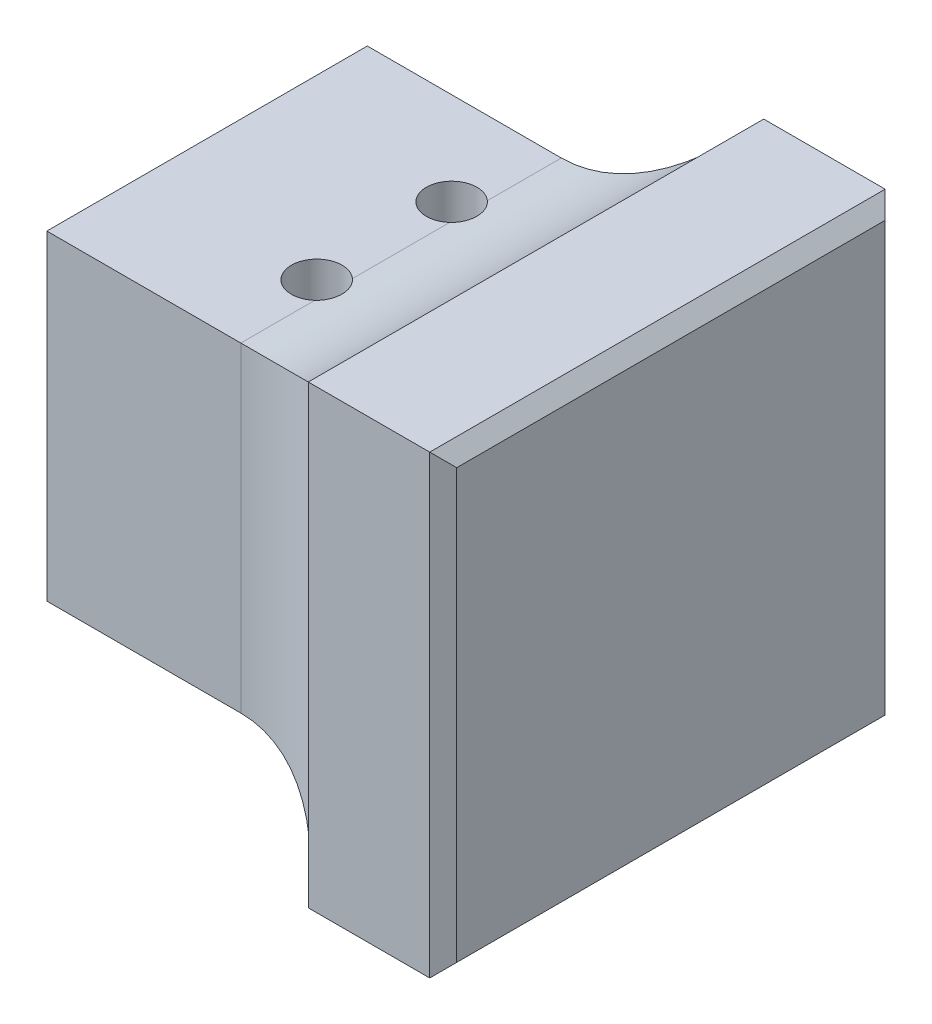
ISO-10303-21;
HEADER;
FILE_DESCRIPTION(('STEP AP214'),'2;1');
FILE_NAME('part.step','',(''),(''),'','','');
FILE_SCHEMA(('AUTOMOTIVE_DESIGN { 1 0 10303 214 1 1 1 1 }'));
ENDSEC;
DATA;
#1=APPLICATION_CONTEXT('core data for automotive mechanical design processes');
#2=APPLICATION_PROTOCOL_DEFINITION('international standard','automotive_design',2000,#1);
#3=PRODUCT_CONTEXT('',#1,'mechanical');
#4=PRODUCT('Part','Part','',(#3));
#5=PRODUCT_RELATED_PRODUCT_CATEGORY('part','',(#4));
#6=PRODUCT_DEFINITION_FORMATION('','',#4);
#7=PRODUCT_DEFINITION_CONTEXT('part definition',#1,'design');
#8=PRODUCT_DEFINITION('design','',#6,#7);
#9=PRODUCT_DEFINITION_SHAPE('','',#8);
#10=(LENGTH_UNIT() NAMED_UNIT(*) SI_UNIT(.MILLI.,.METRE.));
#11=(NAMED_UNIT(*) PLANE_ANGLE_UNIT() SI_UNIT($,.RADIAN.));
#12=(NAMED_UNIT(*) SI_UNIT($,.STERADIAN.) SOLID_ANGLE_UNIT());
#13=UNCERTAINTY_MEASURE_WITH_UNIT(LENGTH_MEASURE(1.E-05),#10,'distance_accuracy_value','');
#14=(GEOMETRIC_REPRESENTATION_CONTEXT(3) GLOBAL_UNCERTAINTY_ASSIGNED_CONTEXT((#13)) GLOBAL_UNIT_ASSIGNED_CONTEXT((#10,
#11,#12)) REPRESENTATION_CONTEXT('',''));
#15=CARTESIAN_POINT('',(0.,0.,0.));
#16=DIRECTION('',(0.,0.,1.));
#17=DIRECTION('',(1.,0.,0.));
#18=AXIS2_PLACEMENT_3D('',#15,#16,#17);
#19=CARTESIAN_POINT('',(0.,19.,0.));
#20=DIRECTION('',(0.,-1.,0.));
#21=DIRECTION('',(0.,0.,-1.));
#22=AXIS2_PLACEMENT_3D('',#19,#20,#21);
#23=PLANE('',#22);
#24=DIRECTION('',(1.,0.,0.));
#25=VECTOR('',#24,1.);
#26=CARTESIAN_POINT('',(0.,19.,0.));
#27=LINE('',#26,#25);
#28=CARTESIAN_POINT('',(1.50000000000001,19.,0.));
#29=VERTEX_POINT('',#28);
#30=CARTESIAN_POINT('',(13.,19.,0.));
#31=VERTEX_POINT('',#30);
#32=EDGE_CURVE('E209',#29,#31,#27,.T.);
#33=ORIENTED_EDGE('',*,*,#32,.T.);
#34=DIRECTION('',(0.,0.,1.));
#35=VECTOR('',#34,1.);
#36=CARTESIAN_POINT('',(13.,19.,0.));
#37=LINE('',#36,#35);
#38=CARTESIAN_POINT('',(13.,19.,-4.3819660112501));
#39=VERTEX_POINT('',#38);
#40=EDGE_CURVE('E258',#31,#39,#37,.F.);
#41=ORIENTED_EDGE('',*,*,#40,.T.);
#42=CARTESIAN_POINT('',(12.,19.,-5.5));
#43=DIRECTION('',(0.,1.,0.));
#44=DIRECTION('',(0.,0.,1.));
#45=AXIS2_PLACEMENT_3D('',#42,#43,#44);
#46=CIRCLE('',#45,1.5);
#47=CARTESIAN_POINT('',(13.,19.,-6.6180339887499));
#48=VERTEX_POINT('',#47);
#49=EDGE_CURVE('E195',#48,#39,#46,.T.);
#50=ORIENTED_EDGE('',*,*,#49,.F.);
#51=DIRECTION('',(0.,0.,1.));
#52=VECTOR('',#51,1.);
#53=CARTESIAN_POINT('',(13.,19.,0.));
#54=LINE('',#53,#52);
#55=CARTESIAN_POINT('',(13.,19.,-12.3819660112501));
#56=VERTEX_POINT('',#55);
#57=EDGE_CURVE('E256',#48,#56,#54,.F.);
#58=ORIENTED_EDGE('',*,*,#57,.T.);
#59=CARTESIAN_POINT('',(12.,19.,-13.5));
#60=DIRECTION('',(0.,1.,0.));
#61=DIRECTION('',(0.,0.,1.));
#62=AXIS2_PLACEMENT_3D('',#59,#60,#61);
#63=CIRCLE('',#62,1.5);
#64=CARTESIAN_POINT('',(13.,19.,-14.6180339887499));
#65=VERTEX_POINT('',#64);
#66=EDGE_CURVE('E203',#65,#56,#63,.T.);
#67=ORIENTED_EDGE('',*,*,#66,.F.);
#68=DIRECTION('',(0.,0.,1.));
#69=VECTOR('',#68,1.);
#70=CARTESIAN_POINT('',(13.,19.,0.));
#71=LINE('',#70,#69);
#72=CARTESIAN_POINT('',(13.,19.,-19.));
#73=VERTEX_POINT('',#72);
#74=EDGE_CURVE('E254',#65,#73,#71,.F.);
#75=ORIENTED_EDGE('',*,*,#74,.T.);
#76=DIRECTION('',(-1.,0.,0.));
#77=VECTOR('',#76,1.);
#78=CARTESIAN_POINT('',(0.,19.,-19.));
#79=LINE('',#78,#77);
#80=CARTESIAN_POINT('',(1.50000000000001,19.,-19.));
#81=VERTEX_POINT('',#80);
#82=EDGE_CURVE('E212',#73,#81,#79,.T.);
#83=ORIENTED_EDGE('',*,*,#82,.T.);
#84=DIRECTION('',(0.,0.,1.));
#85=VECTOR('',#84,1.);
#86=CARTESIAN_POINT('',(1.50000000000001,19.,0.));
#87=LINE('',#86,#85);
#88=EDGE_CURVE('E230',#81,#29,#87,.T.);
#89=ORIENTED_EDGE('',*,*,#88,.T.);
#90=EDGE_LOOP('',(#33,#41,#50,#58,#67,#75,#83,#89));
#91=FACE_BOUND('',#90,.T.);
#92=ADVANCED_FACE('F35',(#91),#23,.F.);
#93=CARTESIAN_POINT('',(0.,0.,0.));
#94=DIRECTION('',(0.,-1.,0.));
#95=DIRECTION('',(0.,0.,-1.));
#96=AXIS2_PLACEMENT_3D('',#93,#94,#95);
#97=PLANE('',#96);
#98=DIRECTION('',(-1.,0.,0.));
#99=VECTOR('',#98,1.);
#100=CARTESIAN_POINT('',(0.,0.,-19.));
#101=LINE('',#100,#99);
#102=CARTESIAN_POINT('',(13.,0.,-19.));
#103=VERTEX_POINT('',#102);
#104=CARTESIAN_POINT('',(1.50000000000001,0.,-19.));
#105=VERTEX_POINT('',#104);
#106=EDGE_CURVE('E213',#103,#105,#101,.T.);
#107=ORIENTED_EDGE('',*,*,#106,.F.);
#108=DIRECTION('',(0.,0.,1.));
#109=VECTOR('',#108,1.);
#110=CARTESIAN_POINT('',(13.,0.,0.));
#111=LINE('',#110,#109);
#112=CARTESIAN_POINT('',(13.,0.,-14.6180339887499));
#113=VERTEX_POINT('',#112);
#114=EDGE_CURVE('E250',#103,#113,#111,.T.);
#115=ORIENTED_EDGE('',*,*,#114,.T.);
#116=CARTESIAN_POINT('',(12.,0.,-13.5));
#117=DIRECTION('',(0.,1.,0.));
#118=DIRECTION('',(0.,0.,1.));
#119=AXIS2_PLACEMENT_3D('',#116,#117,#118);
#120=CIRCLE('',#119,1.5);
#121=CARTESIAN_POINT('',(13.,0.,-12.3819660112501));
#122=VERTEX_POINT('',#121);
#123=EDGE_CURVE('E198',#113,#122,#120,.T.);
#124=ORIENTED_EDGE('',*,*,#123,.T.);
#125=DIRECTION('',(0.,0.,1.));
#126=VECTOR('',#125,1.);
#127=CARTESIAN_POINT('',(13.,0.,0.));
#128=LINE('',#127,#126);
#129=CARTESIAN_POINT('',(13.,0.,-6.6180339887499));
#130=VERTEX_POINT('',#129);
#131=EDGE_CURVE('E248',#122,#130,#128,.T.);
#132=ORIENTED_EDGE('',*,*,#131,.T.);
#133=CARTESIAN_POINT('',(12.,0.,-5.5));
#134=DIRECTION('',(0.,1.,0.));
#135=DIRECTION('',(0.,0.,1.));
#136=AXIS2_PLACEMENT_3D('',#133,#134,#135);
#137=CIRCLE('',#136,1.5);
#138=CARTESIAN_POINT('',(13.,0.,-4.3819660112501));
#139=VERTEX_POINT('',#138);
#140=EDGE_CURVE('E199',#130,#139,#137,.T.);
#141=ORIENTED_EDGE('',*,*,#140,.T.);
#142=DIRECTION('',(0.,0.,1.));
#143=VECTOR('',#142,1.);
#144=CARTESIAN_POINT('',(13.,0.,0.));
#145=LINE('',#144,#143);
#146=CARTESIAN_POINT('',(13.,0.,0.));
#147=VERTEX_POINT('',#146);
#148=EDGE_CURVE('E237',#139,#147,#145,.T.);
#149=ORIENTED_EDGE('',*,*,#148,.T.);
#150=DIRECTION('',(1.,0.,0.));
#151=VECTOR('',#150,1.);
#152=CARTESIAN_POINT('',(0.,0.,0.));
#153=LINE('',#152,#151);
#154=CARTESIAN_POINT('',(1.50000000000001,0.,0.));
#155=VERTEX_POINT('',#154);
#156=EDGE_CURVE('E206',#155,#147,#153,.T.);
#157=ORIENTED_EDGE('',*,*,#156,.F.);
#158=DIRECTION('',(0.,0.,-1.));
#159=VECTOR('',#158,1.);
#160=CARTESIAN_POINT('',(1.50000000000001,0.,-19.));
#161=LINE('',#160,#159);
#162=EDGE_CURVE('E234',#155,#105,#161,.T.);
#163=ORIENTED_EDGE('',*,*,#162,.T.);
#164=EDGE_LOOP('',(#107,#115,#124,#132,#141,#149,#157,#163));
#165=FACE_BOUND('',#164,.T.);
#166=ADVANCED_FACE('F338',(#165),#97,.T.);
#167=CARTESIAN_POINT('',(0.,19.,0.));
#168=DIRECTION('',(1.,0.,0.));
#169=DIRECTION('',(0.,0.,-1.));
#170=AXIS2_PLACEMENT_3D('',#167,#168,#169);
#171=PLANE('',#170);
#172=DIRECTION('',(0.,0.,-1.));
#173=VECTOR('',#172,1.);
#174=CARTESIAN_POINT('',(0.,17.5,0.));
#175=LINE('',#174,#173);
#176=CARTESIAN_POINT('',(0.,17.5,-1.5));
#177=VERTEX_POINT('',#176);
#178=CARTESIAN_POINT('',(0.,17.5,-17.5));
#179=VERTEX_POINT('',#178);
#180=EDGE_CURVE('E222',#177,#179,#175,.T.);
#181=ORIENTED_EDGE('',*,*,#180,.T.);
#182=DIRECTION('',(0.,-1.,0.));
#183=VECTOR('',#182,1.);
#184=CARTESIAN_POINT('',(0.,19.,-17.5));
#185=LINE('',#184,#183);
#186=CARTESIAN_POINT('',(0.,1.5,-17.5));
#187=VERTEX_POINT('',#186);
#188=EDGE_CURVE('E224',#179,#187,#185,.T.);
#189=ORIENTED_EDGE('',*,*,#188,.T.);
#190=DIRECTION('',(0.,0.,1.));
#191=VECTOR('',#190,1.);
#192=CARTESIAN_POINT('',(0.,1.5,0.));
#193=LINE('',#192,#191);
#194=CARTESIAN_POINT('',(0.,1.5,-1.5));
#195=VERTEX_POINT('',#194);
#196=EDGE_CURVE('E215',#187,#195,#193,.T.);
#197=ORIENTED_EDGE('',*,*,#196,.T.);
#198=DIRECTION('',(0.,1.,0.));
#199=VECTOR('',#198,1.);
#200=CARTESIAN_POINT('',(0.,19.,-1.5));
#201=LINE('',#200,#199);
#202=EDGE_CURVE('E220',#195,#177,#201,.T.);
#203=ORIENTED_EDGE('',*,*,#202,.T.);
#204=EDGE_LOOP('',(#181,#189,#197,#203));
#205=FACE_BOUND('',#204,.T.);
#206=ADVANCED_FACE('F343',(#205),#171,.F.);
#207=CARTESIAN_POINT('',(0.,19.,0.));
#208=DIRECTION('',(0.,0.,-1.));
#209=DIRECTION('',(-1.,0.,0.));
#210=AXIS2_PLACEMENT_3D('',#207,#208,#209);
#211=PLANE('',#210);
#212=ORIENTED_EDGE('',*,*,#156,.T.);
#213=DIRECTION('',(0.,-1.,0.));
#214=VECTOR('',#213,1.);
#215=CARTESIAN_POINT('',(13.,19.,0.));
#216=LINE('',#215,#214);
#217=EDGE_CURVE('E173',#147,#31,#216,.F.);
#218=ORIENTED_EDGE('',*,*,#217,.T.);
#219=ORIENTED_EDGE('',*,*,#32,.F.);
#220=DIRECTION('',(0.,-1.,0.));
#221=VECTOR('',#220,1.);
#222=CARTESIAN_POINT('',(1.50000000000001,19.,0.));
#223=LINE('',#222,#221);
#224=EDGE_CURVE('E232',#29,#155,#223,.T.);
#225=ORIENTED_EDGE('',*,*,#224,.T.);
#226=EDGE_LOOP('',(#212,#218,#219,#225));
#227=FACE_BOUND('',#226,.T.);
#228=ADVANCED_FACE('F464',(#227),#211,.F.);
#229=CARTESIAN_POINT('',(0.,19.,-19.));
#230=DIRECTION('',(0.,0.,1.));
#231=DIRECTION('',(1.,0.,0.));
#232=AXIS2_PLACEMENT_3D('',#229,#230,#231);
#233=PLANE('',#232);
#234=ORIENTED_EDGE('',*,*,#82,.F.);
#235=DIRECTION('',(0.,1.,0.));
#236=VECTOR('',#235,1.);
#237=CARTESIAN_POINT('',(13.,19.,-19.));
#238=LINE('',#237,#236);
#239=EDGE_CURVE('E260',#73,#103,#238,.F.);
#240=ORIENTED_EDGE('',*,*,#239,.T.);
#241=ORIENTED_EDGE('',*,*,#106,.T.);
#242=DIRECTION('',(0.,1.,0.));
#243=VECTOR('',#242,1.);
#244=CARTESIAN_POINT('',(1.50000000000001,19.,-19.));
#245=LINE('',#244,#243);
#246=EDGE_CURVE('E227',#105,#81,#245,.T.);
#247=ORIENTED_EDGE('',*,*,#246,.T.);
#248=EDGE_LOOP('',(#234,#240,#241,#247));
#249=FACE_BOUND('',#248,.T.);
#250=ADVANCED_FACE('F285',(#249),#233,.F.);
#251=CARTESIAN_POINT('',(12.,19.,-13.5));
#252=DIRECTION('',(0.,-1.,0.));
#253=DIRECTION('',(0.,0.,-1.));
#254=AXIS2_PLACEMENT_3D('',#251,#252,#253);
#255=CYLINDRICAL_SURFACE('',#254,1.5);
#256=ORIENTED_EDGE('',*,*,#66,.T.);
#257=CARTESIAN_POINT('',(13.,19.,-12.3819660112501));
#258=CARTESIAN_POINT('',(13.0314450404899,18.9999998726787,-12.4100916145278));
#259=CARTESIAN_POINT('',(13.0616877126082,19.0001483195721,-12.4395305646093));
#260=CARTESIAN_POINT('',(13.11958533255,19.0006731951688,-12.5008461926024));
#261=CARTESIAN_POINT('',(13.147240450336,19.001049608886,-12.532722710153));
#262=CARTESIAN_POINT('',(13.2259673309586,19.0024155614752,-12.6316196293879));
#263=CARTESIAN_POINT('',(13.2729079584842,19.0036422790425,-12.7020036008032));
#264=CARTESIAN_POINT('',(13.3543090234248,19.0061951686628,-12.849641836415));
#265=CARTESIAN_POINT('',(13.38876420903,19.0075213822848,-12.926898974725));
#266=CARTESIAN_POINT('',(13.444226606692,19.009832989572,-13.086104044917));
#267=CARTESIAN_POINT('',(13.4652355064595,19.0108184260027,-13.168051386701));
#268=CARTESIAN_POINT('',(13.4932090795529,19.0121601749367,-13.3343487399693));
#269=CARTESIAN_POINT('',(13.5001676700621,19.0125162149464,-13.4186997760686));
#270=CARTESIAN_POINT('',(13.4998261827595,19.0124991218505,-13.5873733641284));
#271=CARTESIAN_POINT('',(13.4925260483815,19.0121259858523,-13.6716959159745));
#272=CARTESIAN_POINT('',(13.4638896426427,19.0107553772105,-13.837819808609));
#273=CARTESIAN_POINT('',(13.4425694184112,19.0097586184171,-13.919623920032));
#274=CARTESIAN_POINT('',(13.3865218211718,19.0074335779821,-14.0784956915318));
#275=CARTESIAN_POINT('',(13.351793076779,19.0061052624347,-14.1555628661935));
#276=CARTESIAN_POINT('',(13.270321818354,19.0035727416623,-14.3020085789191));
#277=CARTESIAN_POINT('',(13.2237144620733,19.0023673408445,-14.3714618051311));
#278=CARTESIAN_POINT('',(13.1456875720227,19.0010274701353,-14.4690951664263));
#279=CARTESIAN_POINT('',(13.1183013358164,19.0006587801918,-14.5005706143263));
#280=CARTESIAN_POINT('',(13.0610018630657,19.0001449768385,-14.5611368254208));
#281=CARTESIAN_POINT('',(13.0310884442664,18.9999998795683,-14.590227416326));
#282=CARTESIAN_POINT('',(13.,19.,-14.6180339887499));
#283=B_SPLINE_CURVE_WITH_KNOTS('',3,(#257,#258,#259,#260,#261,#262,#263,#264,#265,#266,#267,
#268,#269,#270,#271,#272,#273,#274,#275,#276,#277,#278,#279,#280,#281,#282),.UNSPECIFIED.,.F.,
.F.,(4,2,2,2,2,2,2,2,2,2,2,2,4),(0.,0.126485905607502,0.252963497196041,0.505491772367126,
0.758126146723127,1.0107288054512,1.2634408003114,1.516153797714,1.7685780468891,
2.02102812013116,2.27072487574267,2.39576922278843,2.52082259547005),.UNSPECIFIED.);
#284=EDGE_CURVE('E292',#56,#65,#283,.T.);
#285=ORIENTED_EDGE('',*,*,#284,.T.);
#286=EDGE_LOOP('',(#256,#285));
#287=FACE_BOUND('',#286,.T.);
#288=ORIENTED_EDGE('',*,*,#123,.F.);
#289=CARTESIAN_POINT('',(13.,0.,-14.6180339887499));
#290=CARTESIAN_POINT('',(13.0314450404899,1.27321317800919E-07,-14.5899083854722));
#291=CARTESIAN_POINT('',(13.0616877126082,-0.00014831957213464,-14.5604694353907));
#292=CARTESIAN_POINT('',(13.11958533255,-0.000673195168825452,-14.4991538073976));
#293=CARTESIAN_POINT('',(13.147240450336,-0.00104960888599716,-14.467277289847));
#294=CARTESIAN_POINT('',(13.2259673309586,-0.00241556147519206,-14.3683803706121));
#295=CARTESIAN_POINT('',(13.2729079584842,-0.00364227904253221,-14.2979963991968));
#296=CARTESIAN_POINT('',(13.3543090234248,-0.00619516866281442,-14.150358163585));
#297=CARTESIAN_POINT('',(13.38876420903,-0.0075213822847889,-14.073101025275));
#298=CARTESIAN_POINT('',(13.444226606692,-0.00983298957198408,-13.913895955083));
#299=CARTESIAN_POINT('',(13.4652355064595,-0.0108184260027174,-13.831948613299));
#300=CARTESIAN_POINT('',(13.4932090795529,-0.0121601749367112,-13.6656512600307));
#301=CARTESIAN_POINT('',(13.5001676700621,-0.0125162149463531,-13.5813002239314));
#302=CARTESIAN_POINT('',(13.4998261827595,-0.0124991218504954,-13.4126266358716));
#303=CARTESIAN_POINT('',(13.4925260483815,-0.0121259858522626,-13.3283040840255));
#304=CARTESIAN_POINT('',(13.4638896426427,-0.0107553772105174,-13.162180191391));
#305=CARTESIAN_POINT('',(13.4425694184112,-0.0097586184171326,-13.080376079968));
#306=CARTESIAN_POINT('',(13.3865218211718,-0.00743357798211628,-12.9215043084682));
#307=CARTESIAN_POINT('',(13.3517930767789,-0.00610526243472923,-12.8444371338065));
#308=CARTESIAN_POINT('',(13.270321818354,-0.00357274166233139,-12.6979914210809));
#309=CARTESIAN_POINT('',(13.2237144620733,-0.00236734084450203,-12.6285381948689));
#310=CARTESIAN_POINT('',(13.1456875720227,-0.00102747013534093,-12.5309048335737));
#311=CARTESIAN_POINT('',(13.1183013358164,-0.000658780191829888,-12.4994293856737));
#312=CARTESIAN_POINT('',(13.0610018630657,-0.000144976838534495,-12.4388631745792));
#313=CARTESIAN_POINT('',(13.0310884442664,1.20431691219609E-07,-12.409772583674));
#314=CARTESIAN_POINT('',(13.,0.,-12.3819660112501));
#315=B_SPLINE_CURVE_WITH_KNOTS('',3,(#289,#290,#291,#292,#293,#294,#295,#296,#297,#298,#299,
#300,#301,#302,#303,#304,#305,#306,#307,#308,#309,#310,#311,#312,#313,#314),.UNSPECIFIED.,.F.,
.F.,(4,2,2,2,2,2,2,2,2,2,2,2,4),(0.,0.1264859056075,0.252963497196042,0.505491772367128,
0.758126146723129,1.01072880545121,1.26344080031141,1.51615379771401,1.7685780468891,
2.02102812013117,2.27072487574267,2.39576922278842,2.52082259547005),.UNSPECIFIED.);
#316=EDGE_CURVE('E262',#113,#122,#315,.T.);
#317=ORIENTED_EDGE('',*,*,#316,.T.);
#318=EDGE_LOOP('',(#288,#317));
#319=FACE_BOUND('',#318,.T.);
#320=ADVANCED_FACE('F280',(#287,#319),#255,.F.);
#321=CARTESIAN_POINT('',(12.,19.,-5.5));
#322=DIRECTION('',(0.,-1.,0.));
#323=DIRECTION('',(0.,0.,-1.));
#324=AXIS2_PLACEMENT_3D('',#321,#322,#323);
#325=CYLINDRICAL_SURFACE('',#324,1.5);
#326=ORIENTED_EDGE('',*,*,#49,.T.);
#327=CARTESIAN_POINT('',(13.,19.,-4.3819660112501));
#328=CARTESIAN_POINT('',(13.0314450404899,18.9999998726787,-4.4100916145278));
#329=CARTESIAN_POINT('',(13.0616877126082,19.0001483195721,-4.4395305646093));
#330=CARTESIAN_POINT('',(13.11958533255,19.0006731951688,-4.50084619260239));
#331=CARTESIAN_POINT('',(13.147240450336,19.001049608886,-4.53272271015302));
#332=CARTESIAN_POINT('',(13.2259673309586,19.0024155614752,-4.63161962938787));
#333=CARTESIAN_POINT('',(13.2729079584842,19.0036422790425,-4.7020036008032));
#334=CARTESIAN_POINT('',(13.3543090234248,19.0061951686628,-4.84964183641499));
#335=CARTESIAN_POINT('',(13.38876420903,19.0075213822848,-4.92689897472498));
#336=CARTESIAN_POINT('',(13.444226606692,19.009832989572,-5.08610404491703));
#337=CARTESIAN_POINT('',(13.4652355064595,19.0108184260027,-5.16805138670098));
#338=CARTESIAN_POINT('',(13.4932090795529,19.0121601749367,-5.33434873996927));
#339=CARTESIAN_POINT('',(13.5001676700621,19.0125162149464,-5.41869977606858));
#340=CARTESIAN_POINT('',(13.4998261827595,19.0124991218505,-5.58737336412837));
#341=CARTESIAN_POINT('',(13.4925260483815,19.0121259858523,-5.67169591597453));
#342=CARTESIAN_POINT('',(13.4638896426427,19.0107553772105,-5.83781980860904));
#343=CARTESIAN_POINT('',(13.4425694184112,19.0097586184171,-5.91962392003199));
#344=CARTESIAN_POINT('',(13.3865218211718,19.0074335779821,-6.0784956915318));
#345=CARTESIAN_POINT('',(13.3517930767789,19.0061052624347,-6.15556286619351));
#346=CARTESIAN_POINT('',(13.270321818354,19.0035727416623,-6.30200857891914));
#347=CARTESIAN_POINT('',(13.2237144620733,19.0023673408445,-6.37146180513108));
#348=CARTESIAN_POINT('',(13.1456875720227,19.0010274701353,-6.4690951664263));
#349=CARTESIAN_POINT('',(13.1183013358164,19.0006587801918,-6.50057061432631));
#350=CARTESIAN_POINT('',(13.0610018630657,19.0001449768385,-6.56113682542082));
#351=CARTESIAN_POINT('',(13.0310884442664,18.9999998795683,-6.59022741632604));
#352=CARTESIAN_POINT('',(13.,19.,-6.6180339887499));
#353=B_SPLINE_CURVE_WITH_KNOTS('',3,(#327,#328,#329,#330,#331,#332,#333,#334,#335,#336,#337,
#338,#339,#340,#341,#342,#343,#344,#345,#346,#347,#348,#349,#350,#351,#352),.UNSPECIFIED.,.F.,
.F.,(4,2,2,2,2,2,2,2,2,2,2,2,4),(0.,0.126485905607502,0.252963497196041,0.505491772367128,
0.758126146723129,1.01072880545121,1.26344080031141,1.51615379771401,1.7685780468891,
2.02102812013116,2.27072487574267,2.39576922278843,2.52082259547005),.UNSPECIFIED.);
#354=EDGE_CURVE('E300',#39,#48,#353,.T.);
#355=ORIENTED_EDGE('',*,*,#354,.T.);
#356=EDGE_LOOP('',(#326,#355));
#357=FACE_BOUND('',#356,.T.);
#358=ORIENTED_EDGE('',*,*,#140,.F.);
#359=CARTESIAN_POINT('',(13.,0.,-6.6180339887499));
#360=CARTESIAN_POINT('',(13.0314450404899,1.27321319033027E-07,-6.58990838547219));
#361=CARTESIAN_POINT('',(13.0616877126082,-0.000148319572133448,-6.5604694353907));
#362=CARTESIAN_POINT('',(13.11958533255,-0.000673195168825114,-6.4991538073976));
#363=CARTESIAN_POINT('',(13.147240450336,-0.00104960888599763,-6.46727728984698));
#364=CARTESIAN_POINT('',(13.2259673309586,-0.00241556147519346,-6.36838037061213));
#365=CARTESIAN_POINT('',(13.2729079584842,-0.00364227904253228,-6.2979963991968));
#366=CARTESIAN_POINT('',(13.3543090234248,-0.00619516866281433,-6.15035816358501));
#367=CARTESIAN_POINT('',(13.38876420903,-0.00752138228478999,-6.07310102527502));
#368=CARTESIAN_POINT('',(13.444226606692,-0.00983298957198436,-5.91389595508297));
#369=CARTESIAN_POINT('',(13.4652355064595,-0.0108184260027157,-5.83194861329902));
#370=CARTESIAN_POINT('',(13.4932090795529,-0.0121601749367094,-5.66565126003073));
#371=CARTESIAN_POINT('',(13.5001676700621,-0.0125162149463533,-5.58130022393142));
#372=CARTESIAN_POINT('',(13.4998261827595,-0.0124991218504965,-5.41262663587163));
#373=CARTESIAN_POINT('',(13.4925260483815,-0.0121259858522627,-5.32830408402547));
#374=CARTESIAN_POINT('',(13.4638896426427,-0.0107553772105171,-5.16218019139096));
#375=CARTESIAN_POINT('',(13.4425694184112,-0.00975861841713272,-5.08037607996801));
#376=CARTESIAN_POINT('',(13.3865218211718,-0.00743357798211664,-4.9215043084682));
#377=CARTESIAN_POINT('',(13.3517930767789,-0.00610526243472935,-4.84443713380649));
#378=CARTESIAN_POINT('',(13.270321818354,-0.00357274166233119,-4.69799142108086));
#379=CARTESIAN_POINT('',(13.2237144620733,-0.00236734084450174,-4.62853819486892));
#380=CARTESIAN_POINT('',(13.1456875720227,-0.00102747013534062,-4.5309048335737));
#381=CARTESIAN_POINT('',(13.1183013358164,-0.000658780191829589,-4.49942938567369));
#382=CARTESIAN_POINT('',(13.0610018630657,-0.00014497683853426,-4.43886317457918));
#383=CARTESIAN_POINT('',(13.0310884442664,1.20431691403744E-07,-4.40977258367396));
#384=CARTESIAN_POINT('',(13.,0.,-4.3819660112501));
#385=B_SPLINE_CURVE_WITH_KNOTS('',3,(#359,#360,#361,#362,#363,#364,#365,#366,#367,#368,#369,
#370,#371,#372,#373,#374,#375,#376,#377,#378,#379,#380,#381,#382,#383,#384),.UNSPECIFIED.,.F.,
.F.,(4,2,2,2,2,2,2,2,2,2,2,2,4),(0.,0.126485905607502,0.252963497196041,0.505491772367126,
0.758126146723126,1.0107288054512,1.26344080031141,1.51615379771401,1.7685780468891,
2.02102812013116,2.27072487574267,2.39576922278842,2.52082259547005),.UNSPECIFIED.);
#386=EDGE_CURVE('E270',#130,#139,#385,.T.);
#387=ORIENTED_EDGE('',*,*,#386,.T.);
#388=EDGE_LOOP('',(#358,#387));
#389=FACE_BOUND('',#388,.T.);
#390=ADVANCED_FACE('F284',(#357,#389),#325,.F.);
#391=CARTESIAN_POINT('',(1.50000000000001,19.,0.));
#392=DIRECTION('',(0.707106781186547,0.,-0.707106781186548));
#393=DIRECTION('',(0.,-1.,0.));
#394=AXIS2_PLACEMENT_3D('',#391,#392,#393);
#395=PLANE('',#394);
#396=DIRECTION('',(0.577350269189627,-0.577350269189625,0.577350269189625));
#397=VECTOR('',#396,1.);
#398=CARTESIAN_POINT('',(0.500000000000002,1.,-1.));
#399=LINE('',#398,#397);
#400=EDGE_CURVE('E242',#155,#195,#399,.F.);
#401=ORIENTED_EDGE('',*,*,#400,.F.);
#402=ORIENTED_EDGE('',*,*,#224,.F.);
#403=DIRECTION('',(-0.577350269189627,-0.577350269189625,-0.577350269189625));
#404=VECTOR('',#403,1.);
#405=CARTESIAN_POINT('',(1.50000000000001,19.,0.));
#406=LINE('',#405,#404);
#407=EDGE_CURVE('E202',#177,#29,#406,.F.);
#408=ORIENTED_EDGE('',*,*,#407,.F.);
#409=ORIENTED_EDGE('',*,*,#202,.F.);
#410=EDGE_LOOP('',(#401,#402,#408,#409));
#411=FACE_BOUND('',#410,.T.);
#412=ADVANCED_FACE('F428',(#411),#395,.F.);
#413=CARTESIAN_POINT('',(1.50000000000001,19.,0.));
#414=DIRECTION('',(0.707106781186547,-0.707106781186548,0.));
#415=DIRECTION('',(0.,0.,1.));
#416=AXIS2_PLACEMENT_3D('',#413,#414,#415);
#417=PLANE('',#416);
#418=ORIENTED_EDGE('',*,*,#407,.T.);
#419=ORIENTED_EDGE('',*,*,#88,.F.);
#420=DIRECTION('',(-0.577350269189627,-0.577350269189625,0.577350269189625));
#421=VECTOR('',#420,1.);
#422=CARTESIAN_POINT('',(-4.83333333333333,12.6666666666667,-12.6666666666667));
#423=LINE('',#422,#421);
#424=EDGE_CURVE('E239',#179,#81,#423,.F.);
#425=ORIENTED_EDGE('',*,*,#424,.F.);
#426=ORIENTED_EDGE('',*,*,#180,.F.);
#427=EDGE_LOOP('',(#418,#419,#425,#426));
#428=FACE_BOUND('',#427,.T.);
#429=ADVANCED_FACE('F411',(#428),#417,.F.);
#430=CARTESIAN_POINT('',(0.,1.5,0.));
#431=DIRECTION('',(-0.707106781186547,-0.707106781186548,0.));
#432=DIRECTION('',(0.,0.,-1.));
#433=AXIS2_PLACEMENT_3D('',#430,#431,#432);
#434=PLANE('',#433);
#435=ORIENTED_EDGE('',*,*,#400,.T.);
#436=ORIENTED_EDGE('',*,*,#196,.F.);
#437=DIRECTION('',(-0.577350269189627,0.577350269189625,0.577350269189625));
#438=VECTOR('',#437,1.);
#439=CARTESIAN_POINT('',(-5.83333333333334,7.33333333333333,-11.6666666666667));
#440=LINE('',#439,#438);
#441=EDGE_CURVE('E155',#105,#187,#440,.T.);
#442=ORIENTED_EDGE('',*,*,#441,.F.);
#443=ORIENTED_EDGE('',*,*,#162,.F.);
#444=EDGE_LOOP('',(#435,#436,#442,#443));
#445=FACE_BOUND('',#444,.T.);
#446=ADVANCED_FACE('F405',(#445),#434,.T.);
#447=CARTESIAN_POINT('',(0.,19.,-17.5));
#448=DIRECTION('',(0.707106781186547,0.,0.707106781186548));
#449=DIRECTION('',(0.,-1.,0.));
#450=AXIS2_PLACEMENT_3D('',#447,#448,#449);
#451=PLANE('',#450);
#452=ORIENTED_EDGE('',*,*,#424,.T.);
#453=ORIENTED_EDGE('',*,*,#246,.F.);
#454=ORIENTED_EDGE('',*,*,#441,.T.);
#455=ORIENTED_EDGE('',*,*,#188,.F.);
#456=EDGE_LOOP('',(#452,#453,#454,#455));
#457=FACE_BOUND('',#456,.T.);
#458=ADVANCED_FACE('F401',(#457),#451,.F.);
#459=CARTESIAN_POINT('',(29.,-4.,4.));
#460=DIRECTION('',(0.,0.,-1.));
#461=DIRECTION('',(-1.,0.,0.));
#462=AXIS2_PLACEMENT_3D('',#459,#460,#461);
#463=PLANE('',#462);
#464=DIRECTION('',(-1.,0.,0.));
#465=VECTOR('',#464,1.);
#466=CARTESIAN_POINT('',(29.,-4.,4.));
#467=LINE('',#466,#465);
#468=CARTESIAN_POINT('',(28.2,-4.,4.));
#469=VERTEX_POINT('',#468);
#470=CARTESIAN_POINT('',(21.,-4.,4.));
#471=VERTEX_POINT('',#470);
#472=EDGE_CURVE('E148',#469,#471,#467,.T.);
#473=ORIENTED_EDGE('',*,*,#472,.F.);
#474=DIRECTION('',(0.,1.,0.));
#475=VECTOR('',#474,1.);
#476=CARTESIAN_POINT('',(28.2,-4.,4.));
#477=LINE('',#476,#475);
#478=CARTESIAN_POINT('',(28.2,23.,4.));
#479=VERTEX_POINT('',#478);
#480=EDGE_CURVE('E11',#469,#479,#477,.T.);
#481=ORIENTED_EDGE('',*,*,#480,.T.);
#482=DIRECTION('',(-1.,0.,0.));
#483=VECTOR('',#482,1.);
#484=CARTESIAN_POINT('',(29.,23.,4.));
#485=LINE('',#484,#483);
#486=CARTESIAN_POINT('',(21.,23.,4.));
#487=VERTEX_POINT('',#486);
#488=EDGE_CURVE('E163',#479,#487,#485,.T.);
#489=ORIENTED_EDGE('',*,*,#488,.T.);
#490=DIRECTION('',(0.,-1.,0.));
#491=VECTOR('',#490,1.);
#492=CARTESIAN_POINT('',(21.,-4.,4.));
#493=LINE('',#492,#491);
#494=EDGE_CURVE('E159',#487,#471,#493,.T.);
#495=ORIENTED_EDGE('',*,*,#494,.T.);
#496=EDGE_LOOP('',(#473,#481,#489,#495));
#497=FACE_BOUND('',#496,.T.);
#498=ADVANCED_FACE('F161',(#497),#463,.F.);
#499=CARTESIAN_POINT('',(29.,-4.,4.));
#500=DIRECTION('',(0.,1.,0.));
#501=DIRECTION('',(0.,0.,1.));
#502=AXIS2_PLACEMENT_3D('',#499,#500,#501);
#503=PLANE('',#502);
#504=DIRECTION('',(-1.,0.,0.));
#505=VECTOR('',#504,1.);
#506=CARTESIAN_POINT('',(29.,-4.,-23.));
#507=LINE('',#506,#505);
#508=CARTESIAN_POINT('',(28.2,-4.,-23.));
#509=VERTEX_POINT('',#508);
#510=CARTESIAN_POINT('',(21.,-4.,-23.));
#511=VERTEX_POINT('',#510);
#512=EDGE_CURVE('E156',#509,#511,#507,.T.);
#513=ORIENTED_EDGE('',*,*,#512,.F.);
#514=DIRECTION('',(0.,0.,1.));
#515=VECTOR('',#514,1.);
#516=CARTESIAN_POINT('',(28.2,-4.,4.));
#517=LINE('',#516,#515);
#518=EDGE_CURVE('E45',#509,#469,#517,.T.);
#519=ORIENTED_EDGE('',*,*,#518,.T.);
#520=ORIENTED_EDGE('',*,*,#472,.T.);
#521=DIRECTION('',(0.,0.,-1.));
#522=VECTOR('',#521,1.);
#523=CARTESIAN_POINT('',(21.,-4.,4.));
#524=LINE('',#523,#522);
#525=EDGE_CURVE('E152',#471,#511,#524,.T.);
#526=ORIENTED_EDGE('',*,*,#525,.T.);
#527=EDGE_LOOP('',(#513,#519,#520,#526));
#528=FACE_BOUND('',#527,.T.);
#529=ADVANCED_FACE('F150',(#528),#503,.F.);
#530=CARTESIAN_POINT('',(29.,-4.,-23.));
#531=DIRECTION('',(0.,0.,1.));
#532=DIRECTION('',(1.,0.,0.));
#533=AXIS2_PLACEMENT_3D('',#530,#531,#532);
#534=PLANE('',#533);
#535=DIRECTION('',(-1.,0.,0.));
#536=VECTOR('',#535,1.);
#537=CARTESIAN_POINT('',(29.,23.,-23.));
#538=LINE('',#537,#536);
#539=CARTESIAN_POINT('',(28.2,23.,-23.));
#540=VERTEX_POINT('',#539);
#541=CARTESIAN_POINT('',(21.,23.,-23.));
#542=VERTEX_POINT('',#541);
#543=EDGE_CURVE('E192',#540,#542,#538,.T.);
#544=ORIENTED_EDGE('',*,*,#543,.F.);
#545=DIRECTION('',(0.,-1.,0.));
#546=VECTOR('',#545,1.);
#547=CARTESIAN_POINT('',(28.2,-4.,-23.));
#548=LINE('',#547,#546);
#549=EDGE_CURVE('E60',#540,#509,#548,.T.);
#550=ORIENTED_EDGE('',*,*,#549,.T.);
#551=ORIENTED_EDGE('',*,*,#512,.T.);
#552=DIRECTION('',(0.,1.,0.));
#553=VECTOR('',#552,1.);
#554=CARTESIAN_POINT('',(21.,-4.,-23.));
#555=LINE('',#554,#553);
#556=EDGE_CURVE('E184',#511,#542,#555,.T.);
#557=ORIENTED_EDGE('',*,*,#556,.T.);
#558=EDGE_LOOP('',(#544,#550,#551,#557));
#559=FACE_BOUND('',#558,.T.);
#560=ADVANCED_FACE('F394',(#559),#534,.F.);
#561=CARTESIAN_POINT('',(29.,23.,4.));
#562=DIRECTION('',(0.,-1.,0.));
#563=DIRECTION('',(0.,0.,-1.));
#564=AXIS2_PLACEMENT_3D('',#561,#562,#563);
#565=PLANE('',#564);
#566=ORIENTED_EDGE('',*,*,#488,.F.);
#567=DIRECTION('',(0.,0.,-1.));
#568=VECTOR('',#567,1.);
#569=CARTESIAN_POINT('',(28.2,23.,4.));
#570=LINE('',#569,#568);
#571=EDGE_CURVE('E367',#479,#540,#570,.T.);
#572=ORIENTED_EDGE('',*,*,#571,.T.);
#573=ORIENTED_EDGE('',*,*,#543,.T.);
#574=DIRECTION('',(0.,0.,1.));
#575=VECTOR('',#574,1.);
#576=CARTESIAN_POINT('',(21.,23.,4.));
#577=LINE('',#576,#575);
#578=EDGE_CURVE('E187',#542,#487,#577,.T.);
#579=ORIENTED_EDGE('',*,*,#578,.T.);
#580=EDGE_LOOP('',(#566,#572,#573,#579));
#581=FACE_BOUND('',#580,.T.);
#582=ADVANCED_FACE('F386',(#581),#565,.F.);
#583=CARTESIAN_POINT('',(29.,0.,0.));
#584=DIRECTION('',(-1.,0.,0.));
#585=DIRECTION('',(0.,0.,1.));
#586=AXIS2_PLACEMENT_3D('',#583,#584,#585);
#587=PLANE('',#586);
#588=DIRECTION('',(0.,1.,0.));
#589=VECTOR('',#588,1.);
#590=CARTESIAN_POINT('',(29.,0.,-22.2));
#591=LINE('',#590,#589);
#592=CARTESIAN_POINT('',(29.,-3.19999999999999,-22.2));
#593=VERTEX_POINT('',#592);
#594=CARTESIAN_POINT('',(29.,22.2,-22.2));
#595=VERTEX_POINT('',#594);
#596=EDGE_CURVE('E362',#593,#595,#591,.T.);
#597=ORIENTED_EDGE('',*,*,#596,.T.);
#598=DIRECTION('',(0.,0.,1.));
#599=VECTOR('',#598,1.);
#600=CARTESIAN_POINT('',(29.,22.2,0.));
#601=LINE('',#600,#599);
#602=CARTESIAN_POINT('',(29.,22.2,3.19999999999999));
#603=VERTEX_POINT('',#602);
#604=EDGE_CURVE('E364',#595,#603,#601,.T.);
#605=ORIENTED_EDGE('',*,*,#604,.T.);
#606=DIRECTION('',(0.,-1.,0.));
#607=VECTOR('',#606,1.);
#608=CARTESIAN_POINT('',(29.,0.,3.19999999999999));
#609=LINE('',#608,#607);
#610=CARTESIAN_POINT('',(29.,-3.19999999999999,3.19999999999999));
#611=VERTEX_POINT('',#610);
#612=EDGE_CURVE('E299',#603,#611,#609,.T.);
#613=ORIENTED_EDGE('',*,*,#612,.T.);
#614=DIRECTION('',(0.,0.,-1.));
#615=VECTOR('',#614,1.);
#616=CARTESIAN_POINT('',(29.,-3.19999999999999,0.));
#617=LINE('',#616,#615);
#618=EDGE_CURVE('E360',#611,#593,#617,.T.);
#619=ORIENTED_EDGE('',*,*,#618,.T.);
#620=EDGE_LOOP('',(#597,#605,#613,#619));
#621=FACE_BOUND('',#620,.T.);
#622=ADVANCED_FACE('F310',(#621),#587,.F.);
#623=CARTESIAN_POINT('',(13.,29.,0.));
#624=DIRECTION('',(0.,0.,1.));
#625=DIRECTION('',(1.,0.,0.));
#626=AXIS2_PLACEMENT_3D('',#623,#624,#625);
#627=CYLINDRICAL_SURFACE('',#626,10.);
#628=ORIENTED_EDGE('',*,*,#354,.F.);
#629=ORIENTED_EDGE('',*,*,#40,.F.);
#630=CARTESIAN_POINT('',(13.,29.,10.));
#631=DIRECTION('',(0.,-0.707106781186547,0.707106781186547));
#632=DIRECTION('',(0.,-0.707106781186547,-0.707106781186547));
#633=AXIS2_PLACEMENT_3D('',#630,#631,#632);
#634=ELLIPSE('',#633,14.1421356237309,10.);
#635=EDGE_CURVE('E167',#487,#31,#634,.F.);
#636=ORIENTED_EDGE('',*,*,#635,.F.);
#637=ORIENTED_EDGE('',*,*,#578,.F.);
#638=CARTESIAN_POINT('',(13.,29.,-29.));
#639=DIRECTION('',(0.,0.707106781186547,0.707106781186547));
#640=DIRECTION('',(0.,0.707106781186547,-0.707106781186547));
#641=AXIS2_PLACEMENT_3D('',#638,#639,#640);
#642=ELLIPSE('',#641,14.1421356237309,10.);
#643=EDGE_CURVE('E176',#73,#542,#642,.T.);
#644=ORIENTED_EDGE('',*,*,#643,.F.);
#645=ORIENTED_EDGE('',*,*,#74,.F.);
#646=ORIENTED_EDGE('',*,*,#284,.F.);
#647=ORIENTED_EDGE('',*,*,#57,.F.);
#648=EDGE_LOOP('',(#628,#629,#636,#637,#644,#645,#646,#647));
#649=FACE_BOUND('',#648,.T.);
#650=ADVANCED_FACE('F305',(#649),#627,.F.);
#651=CARTESIAN_POINT('',(13.,0.,10.));
#652=DIRECTION('',(0.,-1.,0.));
#653=DIRECTION('',(0.,0.,-1.));
#654=AXIS2_PLACEMENT_3D('',#651,#652,#653);
#655=CYLINDRICAL_SURFACE('',#654,10.);
#656=ORIENTED_EDGE('',*,*,#635,.T.);
#657=ORIENTED_EDGE('',*,*,#217,.F.);
#658=CARTESIAN_POINT('',(13.,-10.,10.));
#659=DIRECTION('',(0.,-0.707106781186547,-0.707106781186547));
#660=DIRECTION('',(0.,-0.707106781186547,0.707106781186547));
#661=AXIS2_PLACEMENT_3D('',#658,#659,#660);
#662=ELLIPSE('',#661,14.1421356237309,10.);
#663=EDGE_CURVE('E171',#471,#147,#662,.F.);
#664=ORIENTED_EDGE('',*,*,#663,.F.);
#665=ORIENTED_EDGE('',*,*,#494,.F.);
#666=EDGE_LOOP('',(#656,#657,#664,#665));
#667=FACE_BOUND('',#666,.T.);
#668=ADVANCED_FACE('F172',(#667),#655,.F.);
#669=CARTESIAN_POINT('',(13.,0.,-29.));
#670=DIRECTION('',(0.,1.,0.));
#671=DIRECTION('',(0.,0.,1.));
#672=AXIS2_PLACEMENT_3D('',#669,#670,#671);
#673=CYLINDRICAL_SURFACE('',#672,10.);
#674=ORIENTED_EDGE('',*,*,#643,.T.);
#675=ORIENTED_EDGE('',*,*,#556,.F.);
#676=CARTESIAN_POINT('',(13.,-10.,-29.));
#677=DIRECTION('',(0.,0.707106781186547,-0.707106781186547));
#678=DIRECTION('',(0.,-0.707106781186547,-0.707106781186547));
#679=AXIS2_PLACEMENT_3D('',#676,#677,#678);
#680=ELLIPSE('',#679,14.1421356237309,10.);
#681=EDGE_CURVE('E177',#103,#511,#680,.T.);
#682=ORIENTED_EDGE('',*,*,#681,.F.);
#683=ORIENTED_EDGE('',*,*,#239,.F.);
#684=EDGE_LOOP('',(#674,#675,#682,#683));
#685=FACE_BOUND('',#684,.T.);
#686=ADVANCED_FACE('F454',(#685),#673,.F.);
#687=CARTESIAN_POINT('',(13.,-10.,0.));
#688=DIRECTION('',(0.,0.,-1.));
#689=DIRECTION('',(-1.,0.,0.));
#690=AXIS2_PLACEMENT_3D('',#687,#688,#689);
#691=CYLINDRICAL_SURFACE('',#690,10.);
#692=ORIENTED_EDGE('',*,*,#316,.F.);
#693=ORIENTED_EDGE('',*,*,#114,.F.);
#694=ORIENTED_EDGE('',*,*,#681,.T.);
#695=ORIENTED_EDGE('',*,*,#525,.F.);
#696=ORIENTED_EDGE('',*,*,#663,.T.);
#697=ORIENTED_EDGE('',*,*,#148,.F.);
#698=ORIENTED_EDGE('',*,*,#386,.F.);
#699=ORIENTED_EDGE('',*,*,#131,.F.);
#700=EDGE_LOOP('',(#692,#693,#694,#695,#696,#697,#698,#699));
#701=FACE_BOUND('',#700,.T.);
#702=ADVANCED_FACE('F180',(#701),#691,.F.);
#703=CARTESIAN_POINT('',(29.,-3.19999999999999,0.));
#704=DIRECTION('',(-0.707106781186544,0.707106781186551,0.));
#705=DIRECTION('',(0.,0.,-1.));
#706=AXIS2_PLACEMENT_3D('',#703,#704,#705);
#707=PLANE('',#706);
#708=DIRECTION('',(0.577350269189629,0.577350269189624,-0.577350269189624));
#709=VECTOR('',#708,1.);
#710=CARTESIAN_POINT('',(30.0666666666667,-2.13333333333333,2.13333333333333));
#711=LINE('',#710,#709);
#712=EDGE_CURVE('E375',#469,#611,#711,.T.);
#713=ORIENTED_EDGE('',*,*,#712,.F.);
#714=ORIENTED_EDGE('',*,*,#518,.F.);
#715=DIRECTION('',(0.577350269189629,0.577350269189624,0.577350269189624));
#716=VECTOR('',#715,1.);
#717=CARTESIAN_POINT('',(36.4,4.19999999999996,-14.8));
#718=LINE('',#717,#716);
#719=EDGE_CURVE('E40',#593,#509,#718,.F.);
#720=ORIENTED_EDGE('',*,*,#719,.F.);
#721=ORIENTED_EDGE('',*,*,#618,.F.);
#722=EDGE_LOOP('',(#713,#714,#720,#721));
#723=FACE_BOUND('',#722,.T.);
#724=ADVANCED_FACE('F38',(#723),#707,.F.);
#725=CARTESIAN_POINT('',(29.,0.,-22.2));
#726=DIRECTION('',(-0.707106781186544,0.,0.707106781186551));
#727=DIRECTION('',(0.,1.,0.));
#728=AXIS2_PLACEMENT_3D('',#725,#726,#727);
#729=PLANE('',#728);
#730=ORIENTED_EDGE('',*,*,#719,.T.);
#731=ORIENTED_EDGE('',*,*,#549,.F.);
#732=DIRECTION('',(0.577350269189629,-0.577350269189624,0.577350269189624));
#733=VECTOR('',#732,1.);
#734=CARTESIAN_POINT('',(36.4,14.8,-14.8));
#735=LINE('',#734,#733);
#736=EDGE_CURVE('E374',#595,#540,#735,.F.);
#737=ORIENTED_EDGE('',*,*,#736,.F.);
#738=ORIENTED_EDGE('',*,*,#596,.F.);
#739=EDGE_LOOP('',(#730,#731,#737,#738));
#740=FACE_BOUND('',#739,.T.);
#741=ADVANCED_FACE('F326',(#740),#729,.F.);
#742=CARTESIAN_POINT('',(29.,0.,3.19999999999999));
#743=DIRECTION('',(-0.707106781186544,0.,-0.707106781186551));
#744=DIRECTION('',(0.,-1.,0.));
#745=AXIS2_PLACEMENT_3D('',#742,#743,#744);
#746=PLANE('',#745);
#747=ORIENTED_EDGE('',*,*,#712,.T.);
#748=ORIENTED_EDGE('',*,*,#612,.F.);
#749=DIRECTION('',(-0.577350269189629,0.577350269189624,0.577350269189624));
#750=VECTOR('',#749,1.);
#751=CARTESIAN_POINT('',(36.4,14.8,-4.19999999999996));
#752=LINE('',#751,#750);
#753=EDGE_CURVE('E372',#479,#603,#752,.F.);
#754=ORIENTED_EDGE('',*,*,#753,.F.);
#755=ORIENTED_EDGE('',*,*,#480,.F.);
#756=EDGE_LOOP('',(#747,#748,#754,#755));
#757=FACE_BOUND('',#756,.T.);
#758=ADVANCED_FACE('F320',(#757),#746,.F.);
#759=CARTESIAN_POINT('',(29.,22.2,0.));
#760=DIRECTION('',(-0.707106781186544,-0.707106781186551,0.));
#761=DIRECTION('',(0.,0.,1.));
#762=AXIS2_PLACEMENT_3D('',#759,#760,#761);
#763=PLANE('',#762);
#764=ORIENTED_EDGE('',*,*,#736,.T.);
#765=ORIENTED_EDGE('',*,*,#571,.F.);
#766=ORIENTED_EDGE('',*,*,#753,.T.);
#767=ORIENTED_EDGE('',*,*,#604,.F.);
#768=EDGE_LOOP('',(#764,#765,#766,#767));
#769=FACE_BOUND('',#768,.T.);
#770=ADVANCED_FACE('F313',(#769),#763,.F.);
#771=CLOSED_SHELL('',(#92,#166,#206,#228,#250,#320,#390,#412,#429,#446,#458,#498,#529,#560,#582,
#622,#650,#668,#686,#702,#724,#741,#758,#770));
#772=MANIFOLD_SOLID_BREP('B2',#771);
#773=ADVANCED_BREP_SHAPE_REPRESENTATION('',(#18,#772),#14);
#774=SHAPE_DEFINITION_REPRESENTATION(#9,#773);
ENDSEC;
END-ISO-10303-21;
